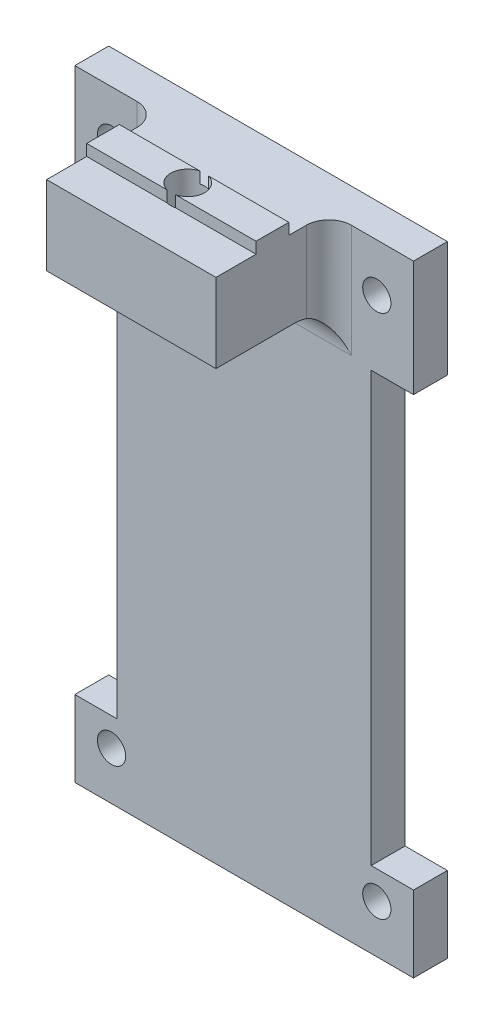
ISO-10303-21;
HEADER;
FILE_DESCRIPTION(('STEP AP214'),'2;1');
FILE_NAME('part.step','',(''),(''),'','','');
FILE_SCHEMA(('AUTOMOTIVE_DESIGN { 1 0 10303 214 1 1 1 1 }'));
ENDSEC;
DATA;
#1=APPLICATION_CONTEXT('core data for automotive mechanical design processes');
#2=APPLICATION_PROTOCOL_DEFINITION('international standard','automotive_design',2000,#1);
#3=PRODUCT_CONTEXT('',#1,'mechanical');
#4=PRODUCT('Part','Part','',(#3));
#5=PRODUCT_RELATED_PRODUCT_CATEGORY('part','',(#4));
#6=PRODUCT_DEFINITION_FORMATION('','',#4);
#7=PRODUCT_DEFINITION_CONTEXT('part definition',#1,'design');
#8=PRODUCT_DEFINITION('design','',#6,#7);
#9=PRODUCT_DEFINITION_SHAPE('','',#8);
#10=(LENGTH_UNIT() NAMED_UNIT(*) SI_UNIT(.MILLI.,.METRE.));
#11=(NAMED_UNIT(*) PLANE_ANGLE_UNIT() SI_UNIT($,.RADIAN.));
#12=(NAMED_UNIT(*) SI_UNIT($,.STERADIAN.) SOLID_ANGLE_UNIT());
#13=UNCERTAINTY_MEASURE_WITH_UNIT(LENGTH_MEASURE(1.E-05),#10,'distance_accuracy_value','');
#14=(GEOMETRIC_REPRESENTATION_CONTEXT(3) GLOBAL_UNCERTAINTY_ASSIGNED_CONTEXT((#13)) GLOBAL_UNIT_ASSIGNED_CONTEXT((#10,
#11,#12)) REPRESENTATION_CONTEXT('',''));
#15=CARTESIAN_POINT('',(0.,0.,0.));
#16=DIRECTION('',(0.,0.,1.));
#17=DIRECTION('',(1.,0.,0.));
#18=AXIS2_PLACEMENT_3D('',#15,#16,#17);
#19=CARTESIAN_POINT('',(7.5,56.,6.55));
#20=DIRECTION('',(0.,0.,1.));
#21=DIRECTION('',(1.,0.,0.));
#22=AXIS2_PLACEMENT_3D('',#19,#20,#21);
#23=PLANE('',#22);
#24=DIRECTION('',(-1.,0.,0.));
#25=VECTOR('',#24,1.);
#26=CARTESIAN_POINT('',(7.5,55.,6.55));
#27=LINE('',#26,#25);
#28=CARTESIAN_POINT('',(7.5,55.,6.55));
#29=VERTEX_POINT('',#28);
#30=CARTESIAN_POINT('',(0.384057287393445,55.,6.55));
#31=VERTEX_POINT('',#30);
#32=EDGE_CURVE('E246',#29,#31,#27,.T.);
#33=ORIENTED_EDGE('',*,*,#32,.T.);
#34=DIRECTION('',(0.,1.,0.));
#35=VECTOR('',#34,1.);
#36=CARTESIAN_POINT('',(0.384057287393445,0.,6.55));
#37=LINE('',#36,#35);
#38=CARTESIAN_POINT('',(0.384057287393445,56.,6.55));
#39=VERTEX_POINT('',#38);
#40=EDGE_CURVE('E514',#31,#39,#37,.T.);
#41=ORIENTED_EDGE('',*,*,#40,.T.);
#42=DIRECTION('',(-1.,0.,0.));
#43=VECTOR('',#42,1.);
#44=CARTESIAN_POINT('',(7.5,56.,6.55));
#45=LINE('',#44,#43);
#46=CARTESIAN_POINT('',(7.5,56.,6.55));
#47=VERTEX_POINT('',#46);
#48=EDGE_CURVE('E232',#47,#39,#45,.T.);
#49=ORIENTED_EDGE('',*,*,#48,.F.);
#50=DIRECTION('',(0.,1.,0.));
#51=VECTOR('',#50,1.);
#52=CARTESIAN_POINT('',(7.5,56.,6.55));
#53=LINE('',#52,#51);
#54=EDGE_CURVE('E515',#29,#47,#53,.T.);
#55=ORIENTED_EDGE('',*,*,#54,.F.);
#56=EDGE_LOOP('',(#33,#41,#49,#55));
#57=FACE_BOUND('',#56,.T.);
#58=ADVANCED_FACE('F33',(#57),#23,.F.);
#59=CARTESIAN_POINT('',(7.5,56.,9.45));
#60=DIRECTION('',(0.,-1.,0.));
#61=DIRECTION('',(0.,0.,-1.));
#62=AXIS2_PLACEMENT_3D('',#59,#60,#61);
#63=PLANE('',#62);
#64=ORIENTED_EDGE('',*,*,#48,.T.);
#65=CARTESIAN_POINT('',(0.,56.,8.));
#66=DIRECTION('',(0.,1.,0.));
#67=DIRECTION('',(0.,0.,1.));
#68=AXIS2_PLACEMENT_3D('',#65,#66,#67);
#69=CIRCLE('',#68,1.5);
#70=CARTESIAN_POINT('',(0.384057287393419,56.,9.45));
#71=VERTEX_POINT('',#70);
#72=EDGE_CURVE('E216',#71,#39,#69,.T.);
#73=ORIENTED_EDGE('',*,*,#72,.F.);
#74=DIRECTION('',(-1.,0.,0.));
#75=VECTOR('',#74,1.);
#76=CARTESIAN_POINT('',(7.5,56.,9.45));
#77=LINE('',#76,#75);
#78=CARTESIAN_POINT('',(7.5,56.,9.45));
#79=VERTEX_POINT('',#78);
#80=EDGE_CURVE('E229',#79,#71,#77,.T.);
#81=ORIENTED_EDGE('',*,*,#80,.F.);
#82=DIRECTION('',(0.,0.,1.));
#83=VECTOR('',#82,1.);
#84=CARTESIAN_POINT('',(7.5,56.,9.45));
#85=LINE('',#84,#83);
#86=EDGE_CURVE('E533',#47,#79,#85,.T.);
#87=ORIENTED_EDGE('',*,*,#86,.F.);
#88=EDGE_LOOP('',(#64,#73,#81,#87));
#89=FACE_BOUND('',#88,.T.);
#90=ADVANCED_FACE('F227',(#89),#63,.F.);
#91=CARTESIAN_POINT('',(7.5,55.,9.45));
#92=DIRECTION('',(0.,0.,-1.));
#93=DIRECTION('',(-1.,0.,0.));
#94=AXIS2_PLACEMENT_3D('',#91,#92,#93);
#95=PLANE('',#94);
#96=DIRECTION('',(-1.,0.,0.));
#97=VECTOR('',#96,1.);
#98=CARTESIAN_POINT('',(7.5,55.,9.45));
#99=LINE('',#98,#97);
#100=CARTESIAN_POINT('',(-0.384057287393419,55.,9.45));
#101=VERTEX_POINT('',#100);
#102=CARTESIAN_POINT('',(-7.5,55.,9.45));
#103=VERTEX_POINT('',#102);
#104=EDGE_CURVE('E563',#101,#103,#99,.T.);
#105=ORIENTED_EDGE('',*,*,#104,.F.);
#106=DIRECTION('',(0.,1.,0.));
#107=VECTOR('',#106,1.);
#108=CARTESIAN_POINT('',(-0.384057287393419,0.,9.45));
#109=LINE('',#108,#107);
#110=CARTESIAN_POINT('',(-0.384057287393419,56.,9.45));
#111=VERTEX_POINT('',#110);
#112=EDGE_CURVE('E50',#101,#111,#109,.T.);
#113=ORIENTED_EDGE('',*,*,#112,.T.);
#114=CARTESIAN_POINT('',(-7.5,56.,9.45));
#115=VERTEX_POINT('',#114);
#116=EDGE_CURVE('E238',#111,#115,#77,.T.);
#117=ORIENTED_EDGE('',*,*,#116,.T.);
#118=DIRECTION('',(0.,-1.,0.));
#119=VECTOR('',#118,1.);
#120=CARTESIAN_POINT('',(-7.5,55.,9.45));
#121=LINE('',#120,#119);
#122=EDGE_CURVE('E551',#115,#103,#121,.T.);
#123=ORIENTED_EDGE('',*,*,#122,.T.);
#124=EDGE_LOOP('',(#105,#113,#117,#123));
#125=FACE_BOUND('',#124,.T.);
#126=ADVANCED_FACE('F455',(#125),#95,.F.);
#127=CARTESIAN_POINT('',(0.,0.,3.));
#128=DIRECTION('',(0.,0.,1.));
#129=DIRECTION('',(1.,0.,0.));
#130=AXIS2_PLACEMENT_3D('',#127,#128,#129);
#131=PLANE('',#130);
#132=CARTESIAN_POINT('',(11.75,4.25,3.));
#133=DIRECTION('',(0.,0.,1.));
#134=DIRECTION('',(1.,0.,0.));
#135=AXIS2_PLACEMENT_3D('',#132,#133,#134);
#136=CIRCLE('',#135,1.25);
#137=CARTESIAN_POINT('',(13.,4.25,3.));
#138=VERTEX_POINT('',#137);
#139=EDGE_CURVE('E256',#138,#138,#136,.T.);
#140=ORIENTED_EDGE('',*,*,#139,.F.);
#141=EDGE_LOOP('',(#140));
#142=FACE_BOUND('',#141,.T.);
#143=CARTESIAN_POINT('',(-11.75,50.75,3.));
#144=DIRECTION('',(0.,0.,1.));
#145=DIRECTION('',(1.,0.,0.));
#146=AXIS2_PLACEMENT_3D('',#143,#144,#145);
#147=CIRCLE('',#146,1.25);
#148=CARTESIAN_POINT('',(-10.5,50.75,3.));
#149=VERTEX_POINT('',#148);
#150=EDGE_CURVE('E268',#149,#149,#147,.T.);
#151=ORIENTED_EDGE('',*,*,#150,.F.);
#152=EDGE_LOOP('',(#151));
#153=FACE_BOUND('',#152,.T.);
#154=CARTESIAN_POINT('',(11.75,50.75,3.));
#155=DIRECTION('',(0.,0.,1.));
#156=DIRECTION('',(1.,0.,0.));
#157=AXIS2_PLACEMENT_3D('',#154,#155,#156);
#158=CIRCLE('',#157,1.25);
#159=CARTESIAN_POINT('',(13.,50.75,3.));
#160=VERTEX_POINT('',#159);
#161=EDGE_CURVE('E262',#160,#160,#158,.T.);
#162=ORIENTED_EDGE('',*,*,#161,.F.);
#163=EDGE_LOOP('',(#162));
#164=FACE_BOUND('',#163,.T.);
#165=CARTESIAN_POINT('',(-11.75,4.25,3.));
#166=DIRECTION('',(0.,0.,1.));
#167=DIRECTION('',(1.,0.,0.));
#168=AXIS2_PLACEMENT_3D('',#165,#166,#167);
#169=CIRCLE('',#168,1.25);
#170=CARTESIAN_POINT('',(-10.5,4.25,3.));
#171=VERTEX_POINT('',#170);
#172=EDGE_CURVE('E250',#171,#171,#169,.T.);
#173=ORIENTED_EDGE('',*,*,#172,.F.);
#174=EDGE_LOOP('',(#173));
#175=FACE_BOUND('',#174,.T.);
#176=DIRECTION('',(-1.,0.,0.));
#177=VECTOR('',#176,1.);
#178=CARTESIAN_POINT('',(15.,55.,3.));
#179=LINE('',#178,#177);
#180=CARTESIAN_POINT('',(15.,55.,3.));
#181=VERTEX_POINT('',#180);
#182=CARTESIAN_POINT('',(9.5,55.,3.));
#183=VERTEX_POINT('',#182);
#184=EDGE_CURVE('E274',#181,#183,#179,.T.);
#185=ORIENTED_EDGE('',*,*,#184,.T.);
#186=DIRECTION('',(0.,1.,0.));
#187=VECTOR('',#186,1.);
#188=CARTESIAN_POINT('',(9.5,0.,3.));
#189=LINE('',#188,#187);
#190=CARTESIAN_POINT('',(9.5,45.,3.));
#191=VERTEX_POINT('',#190);
#192=EDGE_CURVE('E375',#183,#191,#189,.F.);
#193=ORIENTED_EDGE('',*,*,#192,.T.);
#194=DIRECTION('',(-1.,0.,0.));
#195=VECTOR('',#194,1.);
#196=CARTESIAN_POINT('',(0.,45.,3.));
#197=LINE('',#196,#195);
#198=CARTESIAN_POINT('',(-9.5,45.,3.));
#199=VERTEX_POINT('',#198);
#200=EDGE_CURVE('E360',#191,#199,#197,.T.);
#201=ORIENTED_EDGE('',*,*,#200,.T.);
#202=DIRECTION('',(0.,1.,0.));
#203=VECTOR('',#202,1.);
#204=CARTESIAN_POINT('',(-9.5,55.,3.));
#205=LINE('',#204,#203);
#206=CARTESIAN_POINT('',(-9.49999999999999,55.,3.));
#207=VERTEX_POINT('',#206);
#208=EDGE_CURVE('E372',#199,#207,#205,.T.);
#209=ORIENTED_EDGE('',*,*,#208,.T.);
#210=CARTESIAN_POINT('',(-15.,55.,3.));
#211=VERTEX_POINT('',#210);
#212=EDGE_CURVE('E278',#207,#211,#179,.T.);
#213=ORIENTED_EDGE('',*,*,#212,.T.);
#214=DIRECTION('',(0.,-1.,0.));
#215=VECTOR('',#214,1.);
#216=CARTESIAN_POINT('',(-15.,55.,3.));
#217=LINE('',#216,#215);
#218=CARTESIAN_POINT('',(-15.,44.75,3.));
#219=VERTEX_POINT('',#218);
#220=EDGE_CURVE('E277',#211,#219,#217,.T.);
#221=ORIENTED_EDGE('',*,*,#220,.T.);
#222=DIRECTION('',(1.,0.,0.));
#223=VECTOR('',#222,1.);
#224=CARTESIAN_POINT('',(-15.,44.75,3.));
#225=LINE('',#224,#223);
#226=CARTESIAN_POINT('',(-11.25,44.75,3.));
#227=VERTEX_POINT('',#226);
#228=EDGE_CURVE('E280',#219,#227,#225,.T.);
#229=ORIENTED_EDGE('',*,*,#228,.T.);
#230=DIRECTION('',(0.,-1.,0.));
#231=VECTOR('',#230,1.);
#232=CARTESIAN_POINT('',(-11.25,44.75,3.));
#233=LINE('',#232,#231);
#234=CARTESIAN_POINT('',(-11.25,6.75,3.));
#235=VERTEX_POINT('',#234);
#236=EDGE_CURVE('E282',#227,#235,#233,.T.);
#237=ORIENTED_EDGE('',*,*,#236,.T.);
#238=DIRECTION('',(-1.,0.,0.));
#239=VECTOR('',#238,1.);
#240=CARTESIAN_POINT('',(-11.25,6.75,3.));
#241=LINE('',#240,#239);
#242=CARTESIAN_POINT('',(-15.,6.75,3.));
#243=VERTEX_POINT('',#242);
#244=EDGE_CURVE('E284',#235,#243,#241,.T.);
#245=ORIENTED_EDGE('',*,*,#244,.T.);
#246=DIRECTION('',(0.,-1.,0.));
#247=VECTOR('',#246,1.);
#248=CARTESIAN_POINT('',(-15.,6.75,3.));
#249=LINE('',#248,#247);
#250=CARTESIAN_POINT('',(-15.,0.,3.));
#251=VERTEX_POINT('',#250);
#252=EDGE_CURVE('E286',#243,#251,#249,.T.);
#253=ORIENTED_EDGE('',*,*,#252,.T.);
#254=DIRECTION('',(1.,0.,0.));
#255=VECTOR('',#254,1.);
#256=CARTESIAN_POINT('',(-15.,0.,3.));
#257=LINE('',#256,#255);
#258=CARTESIAN_POINT('',(15.,0.,3.));
#259=VERTEX_POINT('',#258);
#260=EDGE_CURVE('E288',#251,#259,#257,.T.);
#261=ORIENTED_EDGE('',*,*,#260,.T.);
#262=DIRECTION('',(0.,1.,0.));
#263=VECTOR('',#262,1.);
#264=CARTESIAN_POINT('',(15.,0.,3.));
#265=LINE('',#264,#263);
#266=CARTESIAN_POINT('',(15.,6.75,3.));
#267=VERTEX_POINT('',#266);
#268=EDGE_CURVE('E290',#259,#267,#265,.T.);
#269=ORIENTED_EDGE('',*,*,#268,.T.);
#270=DIRECTION('',(-1.,0.,0.));
#271=VECTOR('',#270,1.);
#272=CARTESIAN_POINT('',(15.,6.75,3.));
#273=LINE('',#272,#271);
#274=CARTESIAN_POINT('',(11.25,6.75,3.));
#275=VERTEX_POINT('',#274);
#276=EDGE_CURVE('E292',#267,#275,#273,.T.);
#277=ORIENTED_EDGE('',*,*,#276,.T.);
#278=DIRECTION('',(0.,1.,0.));
#279=VECTOR('',#278,1.);
#280=CARTESIAN_POINT('',(11.25,6.75,3.));
#281=LINE('',#280,#279);
#282=CARTESIAN_POINT('',(11.25,44.75,3.));
#283=VERTEX_POINT('',#282);
#284=EDGE_CURVE('E294',#275,#283,#281,.T.);
#285=ORIENTED_EDGE('',*,*,#284,.T.);
#286=DIRECTION('',(1.,0.,0.));
#287=VECTOR('',#286,1.);
#288=CARTESIAN_POINT('',(11.25,44.75,3.));
#289=LINE('',#288,#287);
#290=CARTESIAN_POINT('',(15.,44.75,3.));
#291=VERTEX_POINT('',#290);
#292=EDGE_CURVE('E296',#283,#291,#289,.T.);
#293=ORIENTED_EDGE('',*,*,#292,.T.);
#294=DIRECTION('',(0.,1.,0.));
#295=VECTOR('',#294,1.);
#296=CARTESIAN_POINT('',(15.,44.75,3.));
#297=LINE('',#296,#295);
#298=EDGE_CURVE('E298',#291,#181,#297,.T.);
#299=ORIENTED_EDGE('',*,*,#298,.T.);
#300=EDGE_LOOP('',(#185,#193,#201,#209,#213,#221,#229,#237,#245,#253,#261,#269,#277,#285,#293,#299));
#301=FACE_BOUND('',#300,.T.);
#302=ADVANCED_FACE('F451',(#142,#153,#164,#175,#301),#131,.T.);
#303=CARTESIAN_POINT('',(0.,0.,0.));
#304=DIRECTION('',(0.,0.,1.));
#305=DIRECTION('',(1.,0.,0.));
#306=AXIS2_PLACEMENT_3D('',#303,#304,#305);
#307=PLANE('',#306);
#308=DIRECTION('',(-1.,0.,0.));
#309=VECTOR('',#308,1.);
#310=CARTESIAN_POINT('',(15.,55.,0.));
#311=LINE('',#310,#309);
#312=CARTESIAN_POINT('',(15.,55.,0.));
#313=VERTEX_POINT('',#312);
#314=CARTESIAN_POINT('',(-15.,55.,0.));
#315=VERTEX_POINT('',#314);
#316=EDGE_CURVE('E271',#313,#315,#311,.T.);
#317=ORIENTED_EDGE('',*,*,#316,.F.);
#318=DIRECTION('',(0.,1.,0.));
#319=VECTOR('',#318,1.);
#320=CARTESIAN_POINT('',(15.,44.75,0.));
#321=LINE('',#320,#319);
#322=CARTESIAN_POINT('',(15.,44.75,0.));
#323=VERTEX_POINT('',#322);
#324=EDGE_CURVE('E323',#323,#313,#321,.T.);
#325=ORIENTED_EDGE('',*,*,#324,.F.);
#326=DIRECTION('',(1.,0.,0.));
#327=VECTOR('',#326,1.);
#328=CARTESIAN_POINT('',(11.25,44.75,0.));
#329=LINE('',#328,#327);
#330=CARTESIAN_POINT('',(11.25,44.75,0.));
#331=VERTEX_POINT('',#330);
#332=EDGE_CURVE('E321',#331,#323,#329,.T.);
#333=ORIENTED_EDGE('',*,*,#332,.F.);
#334=DIRECTION('',(0.,1.,0.));
#335=VECTOR('',#334,1.);
#336=CARTESIAN_POINT('',(11.25,6.75,0.));
#337=LINE('',#336,#335);
#338=CARTESIAN_POINT('',(11.25,6.75,0.));
#339=VERTEX_POINT('',#338);
#340=EDGE_CURVE('E319',#339,#331,#337,.T.);
#341=ORIENTED_EDGE('',*,*,#340,.F.);
#342=DIRECTION('',(-1.,0.,0.));
#343=VECTOR('',#342,1.);
#344=CARTESIAN_POINT('',(15.,6.75,0.));
#345=LINE('',#344,#343);
#346=CARTESIAN_POINT('',(15.,6.75,0.));
#347=VERTEX_POINT('',#346);
#348=EDGE_CURVE('E317',#347,#339,#345,.T.);
#349=ORIENTED_EDGE('',*,*,#348,.F.);
#350=DIRECTION('',(0.,1.,0.));
#351=VECTOR('',#350,1.);
#352=CARTESIAN_POINT('',(15.,0.,0.));
#353=LINE('',#352,#351);
#354=CARTESIAN_POINT('',(15.,0.,0.));
#355=VERTEX_POINT('',#354);
#356=EDGE_CURVE('E315',#355,#347,#353,.T.);
#357=ORIENTED_EDGE('',*,*,#356,.F.);
#358=DIRECTION('',(1.,0.,0.));
#359=VECTOR('',#358,1.);
#360=CARTESIAN_POINT('',(-15.,0.,0.));
#361=LINE('',#360,#359);
#362=CARTESIAN_POINT('',(-15.,0.,0.));
#363=VERTEX_POINT('',#362);
#364=EDGE_CURVE('E313',#363,#355,#361,.T.);
#365=ORIENTED_EDGE('',*,*,#364,.F.);
#366=DIRECTION('',(0.,-1.,0.));
#367=VECTOR('',#366,1.);
#368=CARTESIAN_POINT('',(-15.,6.75,0.));
#369=LINE('',#368,#367);
#370=CARTESIAN_POINT('',(-15.,6.75,0.));
#371=VERTEX_POINT('',#370);
#372=EDGE_CURVE('E311',#371,#363,#369,.T.);
#373=ORIENTED_EDGE('',*,*,#372,.F.);
#374=DIRECTION('',(-1.,0.,0.));
#375=VECTOR('',#374,1.);
#376=CARTESIAN_POINT('',(-11.25,6.75,0.));
#377=LINE('',#376,#375);
#378=CARTESIAN_POINT('',(-11.25,6.75,0.));
#379=VERTEX_POINT('',#378);
#380=EDGE_CURVE('E309',#379,#371,#377,.T.);
#381=ORIENTED_EDGE('',*,*,#380,.F.);
#382=DIRECTION('',(0.,-1.,0.));
#383=VECTOR('',#382,1.);
#384=CARTESIAN_POINT('',(-11.25,44.75,0.));
#385=LINE('',#384,#383);
#386=CARTESIAN_POINT('',(-11.25,44.75,0.));
#387=VERTEX_POINT('',#386);
#388=EDGE_CURVE('E307',#387,#379,#385,.T.);
#389=ORIENTED_EDGE('',*,*,#388,.F.);
#390=DIRECTION('',(1.,0.,0.));
#391=VECTOR('',#390,1.);
#392=CARTESIAN_POINT('',(-15.,44.75,0.));
#393=LINE('',#392,#391);
#394=CARTESIAN_POINT('',(-15.,44.75,0.));
#395=VERTEX_POINT('',#394);
#396=EDGE_CURVE('E305',#395,#387,#393,.T.);
#397=ORIENTED_EDGE('',*,*,#396,.F.);
#398=DIRECTION('',(0.,-1.,0.));
#399=VECTOR('',#398,1.);
#400=CARTESIAN_POINT('',(-15.,55.,0.));
#401=LINE('',#400,#399);
#402=EDGE_CURVE('E303',#315,#395,#401,.T.);
#403=ORIENTED_EDGE('',*,*,#402,.F.);
#404=EDGE_LOOP('',(#317,#325,#333,#341,#349,#357,#365,#373,#381,#389,#397,#403));
#405=FACE_BOUND('',#404,.T.);
#406=CARTESIAN_POINT('',(-11.75,50.75,0.));
#407=DIRECTION('',(0.,0.,1.));
#408=DIRECTION('',(1.,0.,0.));
#409=AXIS2_PLACEMENT_3D('',#406,#407,#408);
#410=CIRCLE('',#409,1.25);
#411=CARTESIAN_POINT('',(-10.5,50.75,0.));
#412=VERTEX_POINT('',#411);
#413=EDGE_CURVE('E265',#412,#412,#410,.T.);
#414=ORIENTED_EDGE('',*,*,#413,.T.);
#415=EDGE_LOOP('',(#414));
#416=FACE_BOUND('',#415,.T.);
#417=CARTESIAN_POINT('',(11.75,50.75,0.));
#418=DIRECTION('',(0.,0.,1.));
#419=DIRECTION('',(1.,0.,0.));
#420=AXIS2_PLACEMENT_3D('',#417,#418,#419);
#421=CIRCLE('',#420,1.25);
#422=CARTESIAN_POINT('',(13.,50.75,0.));
#423=VERTEX_POINT('',#422);
#424=EDGE_CURVE('E259',#423,#423,#421,.T.);
#425=ORIENTED_EDGE('',*,*,#424,.T.);
#426=EDGE_LOOP('',(#425));
#427=FACE_BOUND('',#426,.T.);
#428=CARTESIAN_POINT('',(11.75,4.25,0.));
#429=DIRECTION('',(0.,0.,1.));
#430=DIRECTION('',(1.,0.,0.));
#431=AXIS2_PLACEMENT_3D('',#428,#429,#430);
#432=CIRCLE('',#431,1.25);
#433=CARTESIAN_POINT('',(13.,4.25,0.));
#434=VERTEX_POINT('',#433);
#435=EDGE_CURVE('E253',#434,#434,#432,.T.);
#436=ORIENTED_EDGE('',*,*,#435,.T.);
#437=EDGE_LOOP('',(#436));
#438=FACE_BOUND('',#437,.T.);
#439=CARTESIAN_POINT('',(-11.75,4.25,0.));
#440=DIRECTION('',(0.,0.,1.));
#441=DIRECTION('',(1.,0.,0.));
#442=AXIS2_PLACEMENT_3D('',#439,#440,#441);
#443=CIRCLE('',#442,1.25);
#444=CARTESIAN_POINT('',(-10.5,4.25,0.));
#445=VERTEX_POINT('',#444);
#446=EDGE_CURVE('E249',#445,#445,#443,.T.);
#447=ORIENTED_EDGE('',*,*,#446,.T.);
#448=EDGE_LOOP('',(#447));
#449=FACE_BOUND('',#448,.T.);
#450=ADVANCED_FACE('F403',(#405,#416,#427,#438,#449),#307,.F.);
#451=CARTESIAN_POINT('',(15.,55.,3.));
#452=DIRECTION('',(0.,-1.,0.));
#453=DIRECTION('',(0.,0.,-1.));
#454=AXIS2_PLACEMENT_3D('',#451,#452,#453);
#455=PLANE('',#454);
#456=CARTESIAN_POINT('',(-0.384057287393445,55.,6.55));
#457=VERTEX_POINT('',#456);
#458=CARTESIAN_POINT('',(-7.5,55.,6.55));
#459=VERTEX_POINT('',#458);
#460=EDGE_CURVE('E245',#457,#459,#27,.T.);
#461=ORIENTED_EDGE('',*,*,#460,.F.);
#462=CARTESIAN_POINT('',(0.,55.,8.));
#463=DIRECTION('',(0.,-1.,0.));
#464=DIRECTION('',(0.,0.,-1.));
#465=AXIS2_PLACEMENT_3D('',#462,#463,#464);
#466=CIRCLE('',#465,1.5);
#467=EDGE_CURVE('E520',#457,#31,#466,.T.);
#468=ORIENTED_EDGE('',*,*,#467,.T.);
#469=ORIENTED_EDGE('',*,*,#32,.F.);
#470=DIRECTION('',(0.,0.,1.));
#471=VECTOR('',#470,1.);
#472=CARTESIAN_POINT('',(7.5,55.,6.55));
#473=LINE('',#472,#471);
#474=CARTESIAN_POINT('',(7.5,55.,5.));
#475=VERTEX_POINT('',#474);
#476=EDGE_CURVE('E519',#475,#29,#473,.T.);
#477=ORIENTED_EDGE('',*,*,#476,.F.);
#478=CARTESIAN_POINT('',(9.5,55.,5.));
#479=DIRECTION('',(0.,-1.,0.));
#480=DIRECTION('',(0.,0.,-1.));
#481=AXIS2_PLACEMENT_3D('',#478,#479,#480);
#482=CIRCLE('',#481,2.);
#483=EDGE_CURVE('E379',#475,#183,#482,.T.);
#484=ORIENTED_EDGE('',*,*,#483,.T.);
#485=ORIENTED_EDGE('',*,*,#184,.F.);
#486=DIRECTION('',(0.,0.,-1.));
#487=VECTOR('',#486,1.);
#488=CARTESIAN_POINT('',(15.,55.,3.));
#489=LINE('',#488,#487);
#490=EDGE_CURVE('E300',#181,#313,#489,.T.);
#491=ORIENTED_EDGE('',*,*,#490,.T.);
#492=ORIENTED_EDGE('',*,*,#316,.T.);
#493=DIRECTION('',(0.,0.,-1.));
#494=VECTOR('',#493,1.);
#495=CARTESIAN_POINT('',(-15.,55.,3.));
#496=LINE('',#495,#494);
#497=EDGE_CURVE('E357',#211,#315,#496,.T.);
#498=ORIENTED_EDGE('',*,*,#497,.F.);
#499=ORIENTED_EDGE('',*,*,#212,.F.);
#500=CARTESIAN_POINT('',(-9.5,55.,5.));
#501=DIRECTION('',(0.,-1.,0.));
#502=DIRECTION('',(0.,0.,-1.));
#503=AXIS2_PLACEMENT_3D('',#500,#501,#502);
#504=CIRCLE('',#503,2.);
#505=CARTESIAN_POINT('',(-7.5,55.,5.));
#506=VERTEX_POINT('',#505);
#507=EDGE_CURVE('E43',#207,#506,#504,.T.);
#508=ORIENTED_EDGE('',*,*,#507,.T.);
#509=DIRECTION('',(0.,0.,1.));
#510=VECTOR('',#509,1.);
#511=CARTESIAN_POINT('',(-7.5,55.,6.55));
#512=LINE('',#511,#510);
#513=EDGE_CURVE('E525',#506,#459,#512,.T.);
#514=ORIENTED_EDGE('',*,*,#513,.T.);
#515=EDGE_LOOP('',(#461,#468,#469,#477,#484,#485,#491,#492,#498,#499,#508,#514));
#516=FACE_BOUND('',#515,.T.);
#517=ADVANCED_FACE('F395',(#516),#455,.F.);
#518=CARTESIAN_POINT('',(-15.,55.,3.));
#519=DIRECTION('',(1.,0.,0.));
#520=DIRECTION('',(0.,1.,0.));
#521=AXIS2_PLACEMENT_3D('',#518,#519,#520);
#522=PLANE('',#521);
#523=ORIENTED_EDGE('',*,*,#402,.T.);
#524=DIRECTION('',(0.,0.,-1.));
#525=VECTOR('',#524,1.);
#526=CARTESIAN_POINT('',(-15.,44.75,3.));
#527=LINE('',#526,#525);
#528=EDGE_CURVE('E354',#219,#395,#527,.T.);
#529=ORIENTED_EDGE('',*,*,#528,.F.);
#530=ORIENTED_EDGE('',*,*,#220,.F.);
#531=ORIENTED_EDGE('',*,*,#497,.T.);
#532=EDGE_LOOP('',(#523,#529,#530,#531));
#533=FACE_BOUND('',#532,.T.);
#534=ADVANCED_FACE('F402',(#533),#522,.F.);
#535=CARTESIAN_POINT('',(-15.,44.75,3.));
#536=DIRECTION('',(0.,1.,0.));
#537=DIRECTION('',(0.,0.,1.));
#538=AXIS2_PLACEMENT_3D('',#535,#536,#537);
#539=PLANE('',#538);
#540=ORIENTED_EDGE('',*,*,#396,.T.);
#541=DIRECTION('',(0.,0.,-1.));
#542=VECTOR('',#541,1.);
#543=CARTESIAN_POINT('',(-11.25,44.75,3.));
#544=LINE('',#543,#542);
#545=EDGE_CURVE('E351',#227,#387,#544,.T.);
#546=ORIENTED_EDGE('',*,*,#545,.F.);
#547=ORIENTED_EDGE('',*,*,#228,.F.);
#548=ORIENTED_EDGE('',*,*,#528,.T.);
#549=EDGE_LOOP('',(#540,#546,#547,#548));
#550=FACE_BOUND('',#549,.T.);
#551=ADVANCED_FACE('F407',(#550),#539,.F.);
#552=CARTESIAN_POINT('',(-11.25,44.75,3.));
#553=DIRECTION('',(1.,0.,0.));
#554=DIRECTION('',(0.,0.,-1.));
#555=AXIS2_PLACEMENT_3D('',#552,#553,#554);
#556=PLANE('',#555);
#557=ORIENTED_EDGE('',*,*,#388,.T.);
#558=DIRECTION('',(0.,0.,-1.));
#559=VECTOR('',#558,1.);
#560=CARTESIAN_POINT('',(-11.25,6.75,3.));
#561=LINE('',#560,#559);
#562=EDGE_CURVE('E348',#235,#379,#561,.T.);
#563=ORIENTED_EDGE('',*,*,#562,.F.);
#564=ORIENTED_EDGE('',*,*,#236,.F.);
#565=ORIENTED_EDGE('',*,*,#545,.T.);
#566=EDGE_LOOP('',(#557,#563,#564,#565));
#567=FACE_BOUND('',#566,.T.);
#568=ADVANCED_FACE('F411',(#567),#556,.F.);
#569=CARTESIAN_POINT('',(-11.25,6.75,3.));
#570=DIRECTION('',(0.,-1.,0.));
#571=DIRECTION('',(1.,0.,0.));
#572=AXIS2_PLACEMENT_3D('',#569,#570,#571);
#573=PLANE('',#572);
#574=ORIENTED_EDGE('',*,*,#380,.T.);
#575=DIRECTION('',(0.,0.,-1.));
#576=VECTOR('',#575,1.);
#577=CARTESIAN_POINT('',(-15.,6.75,3.));
#578=LINE('',#577,#576);
#579=EDGE_CURVE('E345',#243,#371,#578,.T.);
#580=ORIENTED_EDGE('',*,*,#579,.F.);
#581=ORIENTED_EDGE('',*,*,#244,.F.);
#582=ORIENTED_EDGE('',*,*,#562,.T.);
#583=EDGE_LOOP('',(#574,#580,#581,#582));
#584=FACE_BOUND('',#583,.T.);
#585=ADVANCED_FACE('F415',(#584),#573,.F.);
#586=CARTESIAN_POINT('',(-15.,6.75,3.));
#587=DIRECTION('',(1.,0.,0.));
#588=DIRECTION('',(0.,0.,-1.));
#589=AXIS2_PLACEMENT_3D('',#586,#587,#588);
#590=PLANE('',#589);
#591=ORIENTED_EDGE('',*,*,#372,.T.);
#592=DIRECTION('',(0.,0.,-1.));
#593=VECTOR('',#592,1.);
#594=CARTESIAN_POINT('',(-15.,0.,3.));
#595=LINE('',#594,#593);
#596=EDGE_CURVE('E342',#251,#363,#595,.T.);
#597=ORIENTED_EDGE('',*,*,#596,.F.);
#598=ORIENTED_EDGE('',*,*,#252,.F.);
#599=ORIENTED_EDGE('',*,*,#579,.T.);
#600=EDGE_LOOP('',(#591,#597,#598,#599));
#601=FACE_BOUND('',#600,.T.);
#602=ADVANCED_FACE('F419',(#601),#590,.F.);
#603=CARTESIAN_POINT('',(-15.,0.,3.));
#604=DIRECTION('',(0.,1.,0.));
#605=DIRECTION('',(0.,0.,1.));
#606=AXIS2_PLACEMENT_3D('',#603,#604,#605);
#607=PLANE('',#606);
#608=ORIENTED_EDGE('',*,*,#364,.T.);
#609=DIRECTION('',(0.,0.,-1.));
#610=VECTOR('',#609,1.);
#611=CARTESIAN_POINT('',(15.,0.,3.));
#612=LINE('',#611,#610);
#613=EDGE_CURVE('E339',#259,#355,#612,.T.);
#614=ORIENTED_EDGE('',*,*,#613,.F.);
#615=ORIENTED_EDGE('',*,*,#260,.F.);
#616=ORIENTED_EDGE('',*,*,#596,.T.);
#617=EDGE_LOOP('',(#608,#614,#615,#616));
#618=FACE_BOUND('',#617,.T.);
#619=ADVANCED_FACE('F423',(#618),#607,.F.);
#620=CARTESIAN_POINT('',(15.,0.,3.));
#621=DIRECTION('',(-1.,0.,0.));
#622=DIRECTION('',(0.,0.,1.));
#623=AXIS2_PLACEMENT_3D('',#620,#621,#622);
#624=PLANE('',#623);
#625=ORIENTED_EDGE('',*,*,#356,.T.);
#626=DIRECTION('',(0.,0.,-1.));
#627=VECTOR('',#626,1.);
#628=CARTESIAN_POINT('',(15.,6.75,3.));
#629=LINE('',#628,#627);
#630=EDGE_CURVE('E336',#267,#347,#629,.T.);
#631=ORIENTED_EDGE('',*,*,#630,.F.);
#632=ORIENTED_EDGE('',*,*,#268,.F.);
#633=ORIENTED_EDGE('',*,*,#613,.T.);
#634=EDGE_LOOP('',(#625,#631,#632,#633));
#635=FACE_BOUND('',#634,.T.);
#636=ADVANCED_FACE('F427',(#635),#624,.F.);
#637=CARTESIAN_POINT('',(15.,6.75,3.));
#638=DIRECTION('',(0.,-1.,0.));
#639=DIRECTION('',(1.,0.,0.));
#640=AXIS2_PLACEMENT_3D('',#637,#638,#639);
#641=PLANE('',#640);
#642=ORIENTED_EDGE('',*,*,#348,.T.);
#643=DIRECTION('',(0.,0.,-1.));
#644=VECTOR('',#643,1.);
#645=CARTESIAN_POINT('',(11.25,6.75,3.));
#646=LINE('',#645,#644);
#647=EDGE_CURVE('E333',#275,#339,#646,.T.);
#648=ORIENTED_EDGE('',*,*,#647,.F.);
#649=ORIENTED_EDGE('',*,*,#276,.F.);
#650=ORIENTED_EDGE('',*,*,#630,.T.);
#651=EDGE_LOOP('',(#642,#648,#649,#650));
#652=FACE_BOUND('',#651,.T.);
#653=ADVANCED_FACE('F431',(#652),#641,.F.);
#654=CARTESIAN_POINT('',(11.25,6.75,3.));
#655=DIRECTION('',(-1.,0.,0.));
#656=DIRECTION('',(0.,0.,1.));
#657=AXIS2_PLACEMENT_3D('',#654,#655,#656);
#658=PLANE('',#657);
#659=ORIENTED_EDGE('',*,*,#340,.T.);
#660=DIRECTION('',(0.,0.,-1.));
#661=VECTOR('',#660,1.);
#662=CARTESIAN_POINT('',(11.25,44.75,3.));
#663=LINE('',#662,#661);
#664=EDGE_CURVE('E330',#283,#331,#663,.T.);
#665=ORIENTED_EDGE('',*,*,#664,.F.);
#666=ORIENTED_EDGE('',*,*,#284,.F.);
#667=ORIENTED_EDGE('',*,*,#647,.T.);
#668=EDGE_LOOP('',(#659,#665,#666,#667));
#669=FACE_BOUND('',#668,.T.);
#670=ADVANCED_FACE('F435',(#669),#658,.F.);
#671=CARTESIAN_POINT('',(11.25,44.75,3.));
#672=DIRECTION('',(0.,1.,0.));
#673=DIRECTION('',(0.,0.,1.));
#674=AXIS2_PLACEMENT_3D('',#671,#672,#673);
#675=PLANE('',#674);
#676=ORIENTED_EDGE('',*,*,#332,.T.);
#677=DIRECTION('',(0.,0.,-1.));
#678=VECTOR('',#677,1.);
#679=CARTESIAN_POINT('',(15.,44.75,3.));
#680=LINE('',#679,#678);
#681=EDGE_CURVE('E327',#291,#323,#680,.T.);
#682=ORIENTED_EDGE('',*,*,#681,.F.);
#683=ORIENTED_EDGE('',*,*,#292,.F.);
#684=ORIENTED_EDGE('',*,*,#664,.T.);
#685=EDGE_LOOP('',(#676,#682,#683,#684));
#686=FACE_BOUND('',#685,.T.);
#687=ADVANCED_FACE('F439',(#686),#675,.F.);
#688=CARTESIAN_POINT('',(15.,44.75,3.));
#689=DIRECTION('',(-1.,0.,0.));
#690=DIRECTION('',(0.,-1.,0.));
#691=AXIS2_PLACEMENT_3D('',#688,#689,#690);
#692=PLANE('',#691);
#693=ORIENTED_EDGE('',*,*,#324,.T.);
#694=ORIENTED_EDGE('',*,*,#490,.F.);
#695=ORIENTED_EDGE('',*,*,#298,.F.);
#696=ORIENTED_EDGE('',*,*,#681,.T.);
#697=EDGE_LOOP('',(#693,#694,#695,#696));
#698=FACE_BOUND('',#697,.T.);
#699=ADVANCED_FACE('F443',(#698),#692,.F.);
#700=CARTESIAN_POINT('',(-11.75,50.75,3.));
#701=DIRECTION('',(0.,0.,-1.));
#702=DIRECTION('',(-1.,0.,0.));
#703=AXIS2_PLACEMENT_3D('',#700,#701,#702);
#704=CYLINDRICAL_SURFACE('',#703,1.25);
#705=ORIENTED_EDGE('',*,*,#150,.T.);
#706=EDGE_LOOP('',(#705));
#707=FACE_BOUND('',#706,.T.);
#708=ORIENTED_EDGE('',*,*,#413,.F.);
#709=EDGE_LOOP('',(#708));
#710=FACE_BOUND('',#709,.T.);
#711=ADVANCED_FACE('F447',(#707,#710),#704,.F.);
#712=CARTESIAN_POINT('',(11.75,50.75,3.));
#713=DIRECTION('',(0.,0.,-1.));
#714=DIRECTION('',(-1.,0.,0.));
#715=AXIS2_PLACEMENT_3D('',#712,#713,#714);
#716=CYLINDRICAL_SURFACE('',#715,1.25);
#717=ORIENTED_EDGE('',*,*,#161,.T.);
#718=EDGE_LOOP('',(#717));
#719=FACE_BOUND('',#718,.T.);
#720=ORIENTED_EDGE('',*,*,#424,.F.);
#721=EDGE_LOOP('',(#720));
#722=FACE_BOUND('',#721,.T.);
#723=ADVANCED_FACE('F459',(#719,#722),#716,.F.);
#724=CARTESIAN_POINT('',(11.75,4.25,3.));
#725=DIRECTION('',(0.,0.,-1.));
#726=DIRECTION('',(-1.,0.,0.));
#727=AXIS2_PLACEMENT_3D('',#724,#725,#726);
#728=CYLINDRICAL_SURFACE('',#727,1.25);
#729=ORIENTED_EDGE('',*,*,#139,.T.);
#730=EDGE_LOOP('',(#729));
#731=FACE_BOUND('',#730,.T.);
#732=ORIENTED_EDGE('',*,*,#435,.F.);
#733=EDGE_LOOP('',(#732));
#734=FACE_BOUND('',#733,.T.);
#735=ADVANCED_FACE('F463',(#731,#734),#728,.F.);
#736=CARTESIAN_POINT('',(-11.75,4.25,3.));
#737=DIRECTION('',(0.,0.,-1.));
#738=DIRECTION('',(-1.,0.,0.));
#739=AXIS2_PLACEMENT_3D('',#736,#737,#738);
#740=CYLINDRICAL_SURFACE('',#739,1.25);
#741=ORIENTED_EDGE('',*,*,#172,.T.);
#742=EDGE_LOOP('',(#741));
#743=FACE_BOUND('',#742,.T.);
#744=ORIENTED_EDGE('',*,*,#446,.F.);
#745=EDGE_LOOP('',(#744));
#746=FACE_BOUND('',#745,.T.);
#747=ADVANCED_FACE('F467',(#743,#746),#740,.F.);
#748=CARTESIAN_POINT('',(-0.384057287393445,56.,6.55));
#749=VERTEX_POINT('',#748);
#750=CARTESIAN_POINT('',(-7.5,56.,6.55));
#751=VERTEX_POINT('',#750);
#752=EDGE_CURVE('E237',#749,#751,#45,.T.);
#753=ORIENTED_EDGE('',*,*,#752,.F.);
#754=DIRECTION('',(0.,1.,0.));
#755=VECTOR('',#754,1.);
#756=CARTESIAN_POINT('',(-0.384057287393445,0.,6.55));
#757=LINE('',#756,#755);
#758=EDGE_CURVE('E523',#749,#457,#757,.F.);
#759=ORIENTED_EDGE('',*,*,#758,.T.);
#760=ORIENTED_EDGE('',*,*,#460,.T.);
#761=DIRECTION('',(0.,1.,0.));
#762=VECTOR('',#761,1.);
#763=CARTESIAN_POINT('',(-7.5,56.,6.55));
#764=LINE('',#763,#762);
#765=EDGE_CURVE('E545',#459,#751,#764,.T.);
#766=ORIENTED_EDGE('',*,*,#765,.T.);
#767=EDGE_LOOP('',(#753,#759,#760,#766));
#768=FACE_BOUND('',#767,.T.);
#769=ADVANCED_FACE('F471',(#768),#23,.F.);
#770=ORIENTED_EDGE('',*,*,#116,.F.);
#771=EDGE_CURVE('E233',#749,#111,#69,.T.);
#772=ORIENTED_EDGE('',*,*,#771,.F.);
#773=ORIENTED_EDGE('',*,*,#752,.T.);
#774=DIRECTION('',(0.,0.,1.));
#775=VECTOR('',#774,1.);
#776=CARTESIAN_POINT('',(-7.5,56.,9.45));
#777=LINE('',#776,#775);
#778=EDGE_CURVE('E548',#751,#115,#777,.T.);
#779=ORIENTED_EDGE('',*,*,#778,.T.);
#780=EDGE_LOOP('',(#770,#772,#773,#779));
#781=FACE_BOUND('',#780,.T.);
#782=ADVANCED_FACE('F475',(#781),#63,.F.);
#783=ORIENTED_EDGE('',*,*,#80,.T.);
#784=DIRECTION('',(0.,1.,0.));
#785=VECTOR('',#784,1.);
#786=CARTESIAN_POINT('',(0.384057287393419,0.,9.45));
#787=LINE('',#786,#785);
#788=CARTESIAN_POINT('',(0.384057287393419,55.,9.45));
#789=VERTEX_POINT('',#788);
#790=EDGE_CURVE('E213',#71,#789,#787,.F.);
#791=ORIENTED_EDGE('',*,*,#790,.T.);
#792=CARTESIAN_POINT('',(7.5,55.,9.45));
#793=VERTEX_POINT('',#792);
#794=EDGE_CURVE('E241',#793,#789,#99,.T.);
#795=ORIENTED_EDGE('',*,*,#794,.F.);
#796=DIRECTION('',(0.,-1.,0.));
#797=VECTOR('',#796,1.);
#798=CARTESIAN_POINT('',(7.5,55.,9.45));
#799=LINE('',#798,#797);
#800=EDGE_CURVE('E236',#79,#793,#799,.T.);
#801=ORIENTED_EDGE('',*,*,#800,.F.);
#802=EDGE_LOOP('',(#783,#791,#795,#801));
#803=FACE_BOUND('',#802,.T.);
#804=ADVANCED_FACE('F235',(#803),#95,.F.);
#805=CARTESIAN_POINT('',(7.5,55.,13.));
#806=DIRECTION('',(0.,-1.,0.));
#807=DIRECTION('',(0.,0.,-1.));
#808=AXIS2_PLACEMENT_3D('',#805,#806,#807);
#809=PLANE('',#808);
#810=ORIENTED_EDGE('',*,*,#794,.T.);
#811=CARTESIAN_POINT('',(0.,55.,8.));
#812=DIRECTION('',(0.,-1.,0.));
#813=DIRECTION('',(0.,0.,-1.));
#814=AXIS2_PLACEMENT_3D('',#811,#812,#813);
#815=CIRCLE('',#814,1.5);
#816=EDGE_CURVE('E218',#789,#101,#815,.T.);
#817=ORIENTED_EDGE('',*,*,#816,.T.);
#818=ORIENTED_EDGE('',*,*,#104,.T.);
#819=DIRECTION('',(0.,0.,1.));
#820=VECTOR('',#819,1.);
#821=CARTESIAN_POINT('',(-7.5,55.,13.));
#822=LINE('',#821,#820);
#823=CARTESIAN_POINT('',(-7.5,55.,13.));
#824=VERTEX_POINT('',#823);
#825=EDGE_CURVE('E554',#103,#824,#822,.T.);
#826=ORIENTED_EDGE('',*,*,#825,.T.);
#827=DIRECTION('',(-1.,0.,0.));
#828=VECTOR('',#827,1.);
#829=CARTESIAN_POINT('',(7.5,55.,13.));
#830=LINE('',#829,#828);
#831=CARTESIAN_POINT('',(7.5,55.,13.));
#832=VERTEX_POINT('',#831);
#833=EDGE_CURVE('E561',#832,#824,#830,.T.);
#834=ORIENTED_EDGE('',*,*,#833,.F.);
#835=DIRECTION('',(0.,0.,1.));
#836=VECTOR('',#835,1.);
#837=CARTESIAN_POINT('',(7.5,55.,13.));
#838=LINE('',#837,#836);
#839=EDGE_CURVE('E536',#793,#832,#838,.T.);
#840=ORIENTED_EDGE('',*,*,#839,.F.);
#841=EDGE_LOOP('',(#810,#817,#818,#826,#834,#840));
#842=FACE_BOUND('',#841,.T.);
#843=ADVANCED_FACE('F482',(#842),#809,.F.);
#844=CARTESIAN_POINT('',(7.5,48.,13.));
#845=DIRECTION('',(0.,0.,-1.));
#846=DIRECTION('',(-1.,0.,0.));
#847=AXIS2_PLACEMENT_3D('',#844,#845,#846);
#848=PLANE('',#847);
#849=DIRECTION('',(0.,-1.,0.));
#850=VECTOR('',#849,1.);
#851=CARTESIAN_POINT('',(-7.5,48.,13.));
#852=LINE('',#851,#850);
#853=CARTESIAN_POINT('',(-7.5,48.,13.));
#854=VERTEX_POINT('',#853);
#855=EDGE_CURVE('E556',#824,#854,#852,.T.);
#856=ORIENTED_EDGE('',*,*,#855,.T.);
#857=DIRECTION('',(-1.,0.,0.));
#858=VECTOR('',#857,1.);
#859=CARTESIAN_POINT('',(7.5,48.,13.));
#860=LINE('',#859,#858);
#861=CARTESIAN_POINT('',(7.5,48.,13.));
#862=VERTEX_POINT('',#861);
#863=EDGE_CURVE('E543',#862,#854,#860,.T.);
#864=ORIENTED_EDGE('',*,*,#863,.F.);
#865=DIRECTION('',(0.,-1.,0.));
#866=VECTOR('',#865,1.);
#867=CARTESIAN_POINT('',(7.5,48.,13.));
#868=LINE('',#867,#866);
#869=EDGE_CURVE('E538',#832,#862,#868,.T.);
#870=ORIENTED_EDGE('',*,*,#869,.F.);
#871=ORIENTED_EDGE('',*,*,#833,.T.);
#872=EDGE_LOOP('',(#856,#864,#870,#871));
#873=FACE_BOUND('',#872,.T.);
#874=ADVANCED_FACE('F485',(#873),#848,.F.);
#875=CARTESIAN_POINT('',(7.5,48.,3.));
#876=DIRECTION('',(0.,1.,0.));
#877=DIRECTION('',(0.,0.,1.));
#878=AXIS2_PLACEMENT_3D('',#875,#876,#877);
#879=PLANE('',#878);
#880=CARTESIAN_POINT('',(0.,48.,8.));
#881=DIRECTION('',(0.,1.,0.));
#882=DIRECTION('',(0.,0.,1.));
#883=AXIS2_PLACEMENT_3D('',#880,#881,#882);
#884=CIRCLE('',#883,1.5);
#885=CARTESIAN_POINT('',(0.,48.,9.5));
#886=VERTEX_POINT('',#885);
#887=EDGE_CURVE('E38',#886,#886,#884,.T.);
#888=ORIENTED_EDGE('',*,*,#887,.T.);
#889=EDGE_LOOP('',(#888));
#890=FACE_BOUND('',#889,.T.);
#891=DIRECTION('',(0.,0.,-1.));
#892=VECTOR('',#891,1.);
#893=CARTESIAN_POINT('',(-7.5,48.,3.));
#894=LINE('',#893,#892);
#895=CARTESIAN_POINT('',(-7.5,48.,6.));
#896=VERTEX_POINT('',#895);
#897=EDGE_CURVE('E531',#854,#896,#894,.T.);
#898=ORIENTED_EDGE('',*,*,#897,.T.);
#899=DIRECTION('',(-1.,0.,0.));
#900=VECTOR('',#899,1.);
#901=CARTESIAN_POINT('',(7.5,48.,6.));
#902=LINE('',#901,#900);
#903=CARTESIAN_POINT('',(7.5,48.,6.));
#904=VERTEX_POINT('',#903);
#905=EDGE_CURVE('E362',#896,#904,#902,.F.);
#906=ORIENTED_EDGE('',*,*,#905,.T.);
#907=DIRECTION('',(0.,0.,-1.));
#908=VECTOR('',#907,1.);
#909=CARTESIAN_POINT('',(7.5,48.,3.));
#910=LINE('',#909,#908);
#911=EDGE_CURVE('E540',#862,#904,#910,.T.);
#912=ORIENTED_EDGE('',*,*,#911,.F.);
#913=ORIENTED_EDGE('',*,*,#863,.T.);
#914=EDGE_LOOP('',(#898,#906,#912,#913));
#915=FACE_BOUND('',#914,.T.);
#916=ADVANCED_FACE('F489',(#890,#915),#879,.F.);
#917=CARTESIAN_POINT('',(7.5,0.,0.));
#918=DIRECTION('',(-1.,0.,0.));
#919=DIRECTION('',(0.,0.,1.));
#920=AXIS2_PLACEMENT_3D('',#917,#918,#919);
#921=PLANE('',#920);
#922=CARTESIAN_POINT('',(7.5,45.,6.));
#923=DIRECTION('',(-1.,0.,0.));
#924=DIRECTION('',(0.,0.,1.));
#925=AXIS2_PLACEMENT_3D('',#922,#923,#924);
#926=CIRCLE('',#925,3.);
#927=CARTESIAN_POINT('',(7.5,47.8284271247462,5.));
#928=VERTEX_POINT('',#927);
#929=EDGE_CURVE('E366',#904,#928,#926,.T.);
#930=ORIENTED_EDGE('',*,*,#929,.T.);
#931=DIRECTION('',(0.,1.,0.));
#932=VECTOR('',#931,1.);
#933=CARTESIAN_POINT('',(7.5,0.,5.));
#934=LINE('',#933,#932);
#935=EDGE_CURVE('E369',#928,#475,#934,.T.);
#936=ORIENTED_EDGE('',*,*,#935,.T.);
#937=ORIENTED_EDGE('',*,*,#476,.T.);
#938=ORIENTED_EDGE('',*,*,#54,.T.);
#939=ORIENTED_EDGE('',*,*,#86,.T.);
#940=ORIENTED_EDGE('',*,*,#800,.T.);
#941=ORIENTED_EDGE('',*,*,#839,.T.);
#942=ORIENTED_EDGE('',*,*,#869,.T.);
#943=ORIENTED_EDGE('',*,*,#911,.T.);
#944=EDGE_LOOP('',(#930,#936,#937,#938,#939,#940,#941,#942,#943));
#945=FACE_BOUND('',#944,.T.);
#946=ADVANCED_FACE('F493',(#945),#921,.F.);
#947=CARTESIAN_POINT('',(-7.5,0.,0.));
#948=DIRECTION('',(-1.,0.,0.));
#949=DIRECTION('',(0.,0.,1.));
#950=AXIS2_PLACEMENT_3D('',#947,#948,#949);
#951=PLANE('',#950);
#952=ORIENTED_EDGE('',*,*,#513,.F.);
#953=DIRECTION('',(0.,1.,0.));
#954=VECTOR('',#953,1.);
#955=CARTESIAN_POINT('',(-7.5,45.,5.));
#956=LINE('',#955,#954);
#957=CARTESIAN_POINT('',(-7.5,47.8284271247462,5.));
#958=VERTEX_POINT('',#957);
#959=EDGE_CURVE('E58',#506,#958,#956,.F.);
#960=ORIENTED_EDGE('',*,*,#959,.T.);
#961=CARTESIAN_POINT('',(-7.5,45.,6.));
#962=DIRECTION('',(-1.,0.,0.));
#963=DIRECTION('',(0.,0.,1.));
#964=AXIS2_PLACEMENT_3D('',#961,#962,#963);
#965=CIRCLE('',#964,3.);
#966=EDGE_CURVE('E364',#958,#896,#965,.F.);
#967=ORIENTED_EDGE('',*,*,#966,.T.);
#968=ORIENTED_EDGE('',*,*,#897,.F.);
#969=ORIENTED_EDGE('',*,*,#855,.F.);
#970=ORIENTED_EDGE('',*,*,#825,.F.);
#971=ORIENTED_EDGE('',*,*,#122,.F.);
#972=ORIENTED_EDGE('',*,*,#778,.F.);
#973=ORIENTED_EDGE('',*,*,#765,.F.);
#974=EDGE_LOOP('',(#952,#960,#967,#968,#969,#970,#971,#972,#973));
#975=FACE_BOUND('',#974,.T.);
#976=ADVANCED_FACE('F393',(#975),#951,.T.);
#977=CARTESIAN_POINT('',(0.,45.,6.));
#978=DIRECTION('',(-1.,0.,0.));
#979=DIRECTION('',(0.,0.,1.));
#980=AXIS2_PLACEMENT_3D('',#977,#978,#979);
#981=CYLINDRICAL_SURFACE('',#980,3.);
#982=ORIENTED_EDGE('',*,*,#929,.F.);
#983=ORIENTED_EDGE('',*,*,#905,.F.);
#984=ORIENTED_EDGE('',*,*,#966,.F.);
#985=CARTESIAN_POINT('',(-7.5,47.8284271247462,5.));
#986=CARTESIAN_POINT('',(-7.49999155503509,47.8085070502688,4.94361594444743));
#987=CARTESIAN_POINT('',(-7.50238347095707,47.786886973048,4.88786909475855));
#988=CARTESIAN_POINT('',(-7.51158389686028,47.7405472122196,4.77814902785895));
#989=CARTESIAN_POINT('',(-7.51838564428018,47.7158323213147,4.72417322764301));
#990=CARTESIAN_POINT('',(-7.53593499103551,47.6638043245425,4.61885296789471));
#991=CARTESIAN_POINT('',(-7.54664212178408,47.6365199223747,4.56748746748837));
#992=CARTESIAN_POINT('',(-7.57161665691399,47.5794299188087,4.46706699101029));
#993=CARTESIAN_POINT('',(-7.58588573867057,47.549623133967,4.41801311649193));
#994=CARTESIAN_POINT('',(-7.64067309364308,47.4427647951933,4.25289315377526));
#995=CARTESIAN_POINT('',(-7.68920087639875,47.3600093087302,4.14304885768412));
#996=CARTESIAN_POINT('',(-7.80042012910899,47.1844718166551,3.93933803827304));
#997=CARTESIAN_POINT('',(-7.86317432497026,47.0916463864372,3.84554560467289));
#998=CARTESIAN_POINT('',(-8.02506668300537,46.8616923966539,3.64074279636961));
#999=CARTESIAN_POINT('',(-8.12888978797457,46.7213141580627,3.53710272129046));
#1000=CARTESIAN_POINT('',(-8.34870842794341,46.4322217094586,3.35846668206518));
#1001=CARTESIAN_POINT('',(-8.46472077181728,46.283496123637,3.2835109521063));
#1002=CARTESIAN_POINT('',(-8.65675807252241,46.0408862776506,3.18463330967702));
#1003=CARTESIAN_POINT('',(-8.73049496647802,45.9485230844081,3.15224520363726));
#1004=CARTESIAN_POINT('',(-8.87987495247684,45.7625127889543,3.09689779523984));
#1005=CARTESIAN_POINT('',(-8.95551866561847,45.6688652730567,3.07394160833673));
#1006=CARTESIAN_POINT('',(-9.18393402434108,45.3871097494623,3.01894485126977));
#1007=CARTESIAN_POINT('',(-9.33865085772609,45.1976116741132,3.00054659366591));
#1008=CARTESIAN_POINT('',(-9.49538126864302,45.0056567697599,3.00000400481877));
#1009=CARTESIAN_POINT('',(-9.49769067225496,45.002828339584,3.00000000521536));
#1010=CARTESIAN_POINT('',(-9.5,45.,3.));
#1011=B_SPLINE_CURVE_WITH_KNOTS('',3,(#985,#986,#987,#988,#989,#990,#991,#992,#993,#994,#995,
#996,#997,#998,#999,#1000,#1001,#1002,#1003,#1004,#1005,#1006,#1007,#1008,#1009,#1010),
.UNSPECIFIED.,.F.,.F.,(4,2,2,2,2,2,2,2,2,2,2,2,4),(0.,0.179272158824225,0.358270048541717,
0.535463494925258,0.71274054225016,1.14766579663324,1.58454732757419,2.19039501983591,
2.79708941843106,3.16434808038176,3.53172795410127,4.26418943717289,4.2751438948957),.UNSPECIFIED.);
#1012=EDGE_CURVE('E11',#958,#199,#1011,.T.);
#1013=ORIENTED_EDGE('',*,*,#1012,.T.);
#1014=ORIENTED_EDGE('',*,*,#200,.F.);
#1015=CARTESIAN_POINT('',(7.5,47.8284271247462,5.));
#1016=CARTESIAN_POINT('',(7.49999155503509,47.8085070502688,4.94361594444743));
#1017=CARTESIAN_POINT('',(7.50238347095707,47.786886973048,4.88786909475855));
#1018=CARTESIAN_POINT('',(7.51158389686028,47.7405472122196,4.77814902785895));
#1019=CARTESIAN_POINT('',(7.51838564428018,47.7158323213147,4.72417322764301));
#1020=CARTESIAN_POINT('',(7.53593499103551,47.6638043245425,4.61885296789471));
#1021=CARTESIAN_POINT('',(7.54664212178408,47.6365199223747,4.56748746748837));
#1022=CARTESIAN_POINT('',(7.57161665691399,47.5794299188087,4.46706699101029));
#1023=CARTESIAN_POINT('',(7.58588573867057,47.549623133967,4.41801311649193));
#1024=CARTESIAN_POINT('',(7.64067309364308,47.4427647951933,4.25289315377526));
#1025=CARTESIAN_POINT('',(7.68920087639875,47.3600093087302,4.14304885768412));
#1026=CARTESIAN_POINT('',(7.80042012910899,47.1844718166551,3.93933803827304));
#1027=CARTESIAN_POINT('',(7.86317432497026,47.0916463864372,3.84554560467289));
#1028=CARTESIAN_POINT('',(8.02506668300537,46.8616923966539,3.64074279636961));
#1029=CARTESIAN_POINT('',(8.12888978797457,46.7213141580627,3.53710272129046));
#1030=CARTESIAN_POINT('',(8.34870842794341,46.4322217094586,3.35846668206518));
#1031=CARTESIAN_POINT('',(8.46472077181728,46.283496123637,3.2835109521063));
#1032=CARTESIAN_POINT('',(8.65675807252241,46.0408862776506,3.18463330967702));
#1033=CARTESIAN_POINT('',(8.73049496647802,45.9485230844081,3.15224520363726));
#1034=CARTESIAN_POINT('',(8.87987495247684,45.7625127889543,3.09689779523984));
#1035=CARTESIAN_POINT('',(8.95551866561847,45.6688652730567,3.07394160833673));
#1036=CARTESIAN_POINT('',(9.18393402434108,45.3871097494623,3.01894485126977));
#1037=CARTESIAN_POINT('',(9.33865085772609,45.1976116741132,3.00054659366591));
#1038=CARTESIAN_POINT('',(9.49538126864302,45.0056567697599,3.00000400481877));
#1039=CARTESIAN_POINT('',(9.49769067225496,45.002828339584,3.00000000521536));
#1040=CARTESIAN_POINT('',(9.5,45.,3.));
#1041=B_SPLINE_CURVE_WITH_KNOTS('',3,(#1015,#1016,#1017,#1018,#1019,#1020,#1021,#1022,#1023,
#1024,#1025,#1026,#1027,#1028,#1029,#1030,#1031,#1032,#1033,#1034,#1035,#1036,#1037,#1038,#1039,
#1040),.UNSPECIFIED.,.F.,.F.,(4,2,2,2,2,2,2,2,2,2,2,2,4),(0.,0.179272158824225,
0.358270048541717,0.535463494925258,0.71274054225016,1.14766579663324,1.58454732757419,
2.19039501983591,2.79708941843106,3.16434808038176,3.53172795410127,4.26418943717289,
4.2751438948957),.UNSPECIFIED.);
#1042=EDGE_CURVE('E381',#191,#928,#1041,.F.);
#1043=ORIENTED_EDGE('',*,*,#1042,.T.);
#1044=EDGE_LOOP('',(#982,#983,#984,#1013,#1014,#1043));
#1045=FACE_BOUND('',#1044,.T.);
#1046=ADVANCED_FACE('F389',(#1045),#981,.F.);
#1047=CARTESIAN_POINT('',(9.5,0.,5.));
#1048=DIRECTION('',(0.,1.,0.));
#1049=DIRECTION('',(0.,0.,1.));
#1050=AXIS2_PLACEMENT_3D('',#1047,#1048,#1049);
#1051=CYLINDRICAL_SURFACE('',#1050,2.);
#1052=ORIENTED_EDGE('',*,*,#1042,.F.);
#1053=ORIENTED_EDGE('',*,*,#192,.F.);
#1054=ORIENTED_EDGE('',*,*,#483,.F.);
#1055=ORIENTED_EDGE('',*,*,#935,.F.);
#1056=EDGE_LOOP('',(#1052,#1053,#1054,#1055));
#1057=FACE_BOUND('',#1056,.T.);
#1058=ADVANCED_FACE('F387',(#1057),#1051,.F.);
#1059=CARTESIAN_POINT('',(-9.5,0.,5.));
#1060=DIRECTION('',(0.,-1.,0.));
#1061=DIRECTION('',(0.,0.,-1.));
#1062=AXIS2_PLACEMENT_3D('',#1059,#1060,#1061);
#1063=CYLINDRICAL_SURFACE('',#1062,2.);
#1064=ORIENTED_EDGE('',*,*,#1012,.F.);
#1065=ORIENTED_EDGE('',*,*,#959,.F.);
#1066=ORIENTED_EDGE('',*,*,#507,.F.);
#1067=ORIENTED_EDGE('',*,*,#208,.F.);
#1068=EDGE_LOOP('',(#1064,#1065,#1066,#1067));
#1069=FACE_BOUND('',#1068,.T.);
#1070=ADVANCED_FACE('F35',(#1069),#1063,.F.);
#1071=CARTESIAN_POINT('',(0.,0.,8.));
#1072=DIRECTION('',(0.,1.,0.));
#1073=DIRECTION('',(0.,0.,1.));
#1074=AXIS2_PLACEMENT_3D('',#1071,#1072,#1073);
#1075=CYLINDRICAL_SURFACE('',#1074,1.5);
#1076=ORIENTED_EDGE('',*,*,#887,.F.);
#1077=EDGE_LOOP('',(#1076));
#1078=FACE_BOUND('',#1077,.T.);
#1079=ORIENTED_EDGE('',*,*,#467,.F.);
#1080=ORIENTED_EDGE('',*,*,#758,.F.);
#1081=ORIENTED_EDGE('',*,*,#771,.T.);
#1082=ORIENTED_EDGE('',*,*,#112,.F.);
#1083=ORIENTED_EDGE('',*,*,#816,.F.);
#1084=ORIENTED_EDGE('',*,*,#790,.F.);
#1085=ORIENTED_EDGE('',*,*,#72,.T.);
#1086=ORIENTED_EDGE('',*,*,#40,.F.);
#1087=EDGE_LOOP('',(#1079,#1080,#1081,#1082,#1083,#1084,#1085,#1086));
#1088=FACE_BOUND('',#1087,.T.);
#1089=ADVANCED_FACE('F215',(#1078,#1088),#1075,.F.);
#1090=CLOSED_SHELL('',(#58,#90,#126,#302,#450,#517,#534,#551,#568,#585,#602,#619,#636,#653,#670,
#687,#699,#711,#723,#735,#747,#769,#782,#804,#843,#874,#916,#946,#976,#1046,#1058,#1070,#1089));
#1091=MANIFOLD_SOLID_BREP('B2',#1090);
#1092=ADVANCED_BREP_SHAPE_REPRESENTATION('',(#18,#1091),#14);
#1093=SHAPE_DEFINITION_REPRESENTATION(#9,#1092);
ENDSEC;
END-ISO-10303-21;
